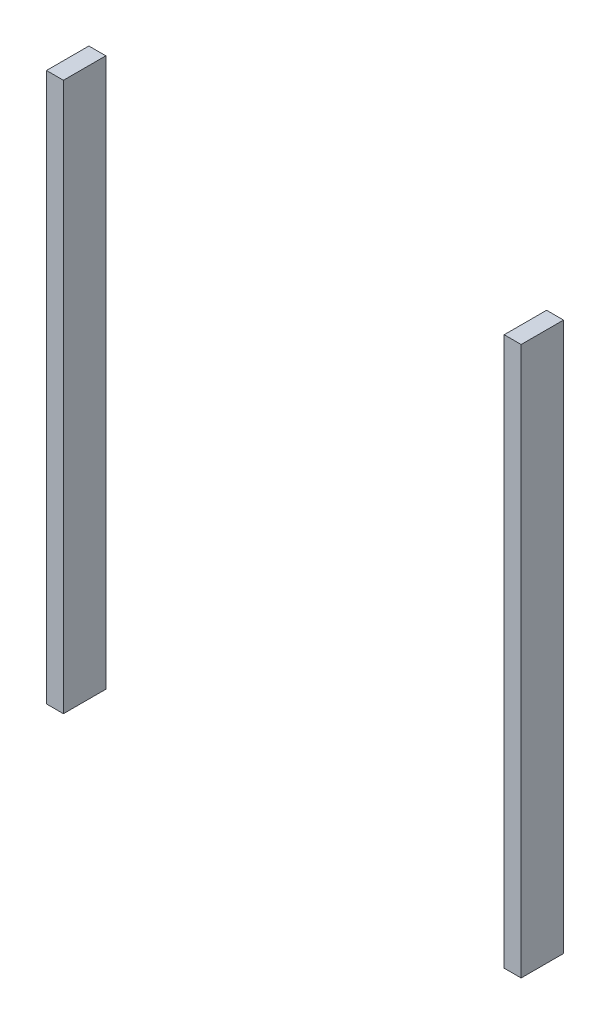
ISO-10303-21;
HEADER;
FILE_DESCRIPTION(('STEP AP214'),'2;1');
FILE_NAME('part.step','',(''),(''),'','','');
FILE_SCHEMA(('AUTOMOTIVE_DESIGN { 1 0 10303 214 1 1 1 1 }'));
ENDSEC;
DATA;
#1=APPLICATION_CONTEXT('core data for automotive mechanical design processes');
#2=APPLICATION_PROTOCOL_DEFINITION('international standard','automotive_design',2000,#1);
#3=PRODUCT_CONTEXT('',#1,'mechanical');
#4=PRODUCT('Part','Part','',(#3));
#5=PRODUCT_RELATED_PRODUCT_CATEGORY('part','',(#4));
#6=PRODUCT_DEFINITION_FORMATION('','',#4);
#7=PRODUCT_DEFINITION_CONTEXT('part definition',#1,'design');
#8=PRODUCT_DEFINITION('design','',#6,#7);
#9=PRODUCT_DEFINITION_SHAPE('','',#8);
#10=(LENGTH_UNIT() NAMED_UNIT(*) SI_UNIT(.MILLI.,.METRE.));
#11=(NAMED_UNIT(*) PLANE_ANGLE_UNIT() SI_UNIT($,.RADIAN.));
#12=(NAMED_UNIT(*) SI_UNIT($,.STERADIAN.) SOLID_ANGLE_UNIT());
#13=UNCERTAINTY_MEASURE_WITH_UNIT(LENGTH_MEASURE(1.E-05),#10,'distance_accuracy_value','');
#14=(GEOMETRIC_REPRESENTATION_CONTEXT(3) GLOBAL_UNCERTAINTY_ASSIGNED_CONTEXT((#13)) GLOBAL_UNIT_ASSIGNED_CONTEXT((#10,
#11,#12)) REPRESENTATION_CONTEXT('',''));
#15=CARTESIAN_POINT('',(0.,0.,0.));
#16=DIRECTION('',(0.,0.,1.));
#17=DIRECTION('',(1.,0.,0.));
#18=AXIS2_PLACEMENT_3D('',#15,#16,#17);
#19=CARTESIAN_POINT('',(65.,-72.0666671000469,6.25));
#20=DIRECTION('',(1.,0.,0.));
#21=DIRECTION('',(0.,0.,-1.));
#22=AXIS2_PLACEMENT_3D('',#19,#20,#21);
#23=PLANE('',#22);
#24=DIRECTION('',(0.,-1.,0.));
#25=VECTOR('',#24,1.);
#26=CARTESIAN_POINT('',(65.,-72.0666671000469,-6.25));
#27=LINE('',#26,#25);
#28=CARTESIAN_POINT('',(65.,89.7489701196322,-6.25));
#29=VERTEX_POINT('',#28);
#30=CARTESIAN_POINT('',(65.,-72.0666671000469,-6.25));
#31=VERTEX_POINT('',#30);
#32=EDGE_CURVE('E12',#29,#31,#27,.T.);
#33=ORIENTED_EDGE('',*,*,#32,.T.);
#34=DIRECTION('',(0.,0.,-1.));
#35=VECTOR('',#34,1.);
#36=CARTESIAN_POINT('',(65.,-72.0666671000469,6.25));
#37=LINE('',#36,#35);
#38=CARTESIAN_POINT('',(65.,-72.0666671000469,6.25));
#39=VERTEX_POINT('',#38);
#40=EDGE_CURVE('E124',#39,#31,#37,.T.);
#41=ORIENTED_EDGE('',*,*,#40,.F.);
#42=DIRECTION('',(0.,-1.,0.));
#43=VECTOR('',#42,1.);
#44=CARTESIAN_POINT('',(65.,-72.0666671000469,6.25));
#45=LINE('',#44,#43);
#46=CARTESIAN_POINT('',(65.,89.7489701196322,6.25));
#47=VERTEX_POINT('',#46);
#48=EDGE_CURVE('E57',#47,#39,#45,.T.);
#49=ORIENTED_EDGE('',*,*,#48,.F.);
#50=DIRECTION('',(0.,0.,-1.));
#51=VECTOR('',#50,1.);
#52=CARTESIAN_POINT('',(65.,89.7489701196322,6.25));
#53=LINE('',#52,#51);
#54=EDGE_CURVE('E112',#47,#29,#53,.T.);
#55=ORIENTED_EDGE('',*,*,#54,.T.);
#56=EDGE_LOOP('',(#33,#41,#49,#55));
#57=FACE_BOUND('',#56,.T.);
#58=ADVANCED_FACE('F53',(#57),#23,.F.);
#59=CARTESIAN_POINT('',(65.,-72.0666671000469,6.25));
#60=DIRECTION('',(0.,1.,0.));
#61=DIRECTION('',(0.,0.,1.));
#62=AXIS2_PLACEMENT_3D('',#59,#60,#61);
#63=PLANE('',#62);
#64=DIRECTION('',(1.,0.,0.));
#65=VECTOR('',#64,1.);
#66=CARTESIAN_POINT('',(65.,-72.0666671000469,-6.25));
#67=LINE('',#66,#65);
#68=CARTESIAN_POINT('',(70.,-72.0666671000469,-6.25));
#69=VERTEX_POINT('',#68);
#70=EDGE_CURVE('E63',#31,#69,#67,.T.);
#71=ORIENTED_EDGE('',*,*,#70,.T.);
#72=DIRECTION('',(0.,0.,-1.));
#73=VECTOR('',#72,1.);
#74=CARTESIAN_POINT('',(70.,-72.0666671000469,6.25));
#75=LINE('',#74,#73);
#76=CARTESIAN_POINT('',(70.,-72.0666671000469,6.25));
#77=VERTEX_POINT('',#76);
#78=EDGE_CURVE('E108',#77,#69,#75,.T.);
#79=ORIENTED_EDGE('',*,*,#78,.F.);
#80=DIRECTION('',(1.,0.,0.));
#81=VECTOR('',#80,1.);
#82=CARTESIAN_POINT('',(65.,-72.0666671000469,6.25));
#83=LINE('',#82,#81);
#84=EDGE_CURVE('E87',#39,#77,#83,.T.);
#85=ORIENTED_EDGE('',*,*,#84,.F.);
#86=ORIENTED_EDGE('',*,*,#40,.T.);
#87=EDGE_LOOP('',(#71,#79,#85,#86));
#88=FACE_BOUND('',#87,.T.);
#89=ADVANCED_FACE('F127',(#88),#63,.F.);
#90=CARTESIAN_POINT('',(70.,-72.0666671000469,6.25));
#91=DIRECTION('',(-1.,0.,0.));
#92=DIRECTION('',(0.,0.,1.));
#93=AXIS2_PLACEMENT_3D('',#90,#91,#92);
#94=PLANE('',#93);
#95=DIRECTION('',(0.,1.,0.));
#96=VECTOR('',#95,1.);
#97=CARTESIAN_POINT('',(70.,-72.0666671000469,-6.25));
#98=LINE('',#97,#96);
#99=CARTESIAN_POINT('',(70.,89.7489701196322,-6.25));
#100=VERTEX_POINT('',#99);
#101=EDGE_CURVE('E103',#69,#100,#98,.T.);
#102=ORIENTED_EDGE('',*,*,#101,.T.);
#103=DIRECTION('',(0.,0.,-1.));
#104=VECTOR('',#103,1.);
#105=CARTESIAN_POINT('',(70.,89.7489701196322,6.25));
#106=LINE('',#105,#104);
#107=CARTESIAN_POINT('',(70.,89.7489701196322,6.25));
#108=VERTEX_POINT('',#107);
#109=EDGE_CURVE('E106',#108,#100,#106,.T.);
#110=ORIENTED_EDGE('',*,*,#109,.F.);
#111=DIRECTION('',(0.,1.,0.));
#112=VECTOR('',#111,1.);
#113=CARTESIAN_POINT('',(70.,-72.0666671000469,6.25));
#114=LINE('',#113,#112);
#115=EDGE_CURVE('E120',#77,#108,#114,.T.);
#116=ORIENTED_EDGE('',*,*,#115,.F.);
#117=ORIENTED_EDGE('',*,*,#78,.T.);
#118=EDGE_LOOP('',(#102,#110,#116,#117));
#119=FACE_BOUND('',#118,.T.);
#120=ADVANCED_FACE('F104',(#119),#94,.F.);
#121=CARTESIAN_POINT('',(65.,89.7489701196322,6.25));
#122=DIRECTION('',(0.,-1.,0.));
#123=DIRECTION('',(0.,0.,-1.));
#124=AXIS2_PLACEMENT_3D('',#121,#122,#123);
#125=PLANE('',#124);
#126=DIRECTION('',(-1.,0.,0.));
#127=VECTOR('',#126,1.);
#128=CARTESIAN_POINT('',(65.,89.7489701196322,-6.25));
#129=LINE('',#128,#127);
#130=EDGE_CURVE('E97',#100,#29,#129,.T.);
#131=ORIENTED_EDGE('',*,*,#130,.T.);
#132=ORIENTED_EDGE('',*,*,#54,.F.);
#133=DIRECTION('',(-1.,0.,0.));
#134=VECTOR('',#133,1.);
#135=CARTESIAN_POINT('',(65.,89.7489701196322,6.25));
#136=LINE('',#135,#134);
#137=EDGE_CURVE('E111',#108,#47,#136,.T.);
#138=ORIENTED_EDGE('',*,*,#137,.F.);
#139=ORIENTED_EDGE('',*,*,#109,.T.);
#140=EDGE_LOOP('',(#131,#132,#138,#139));
#141=FACE_BOUND('',#140,.T.);
#142=ADVANCED_FACE('F110',(#141),#125,.F.);
#143=CARTESIAN_POINT('',(0.,0.,6.25));
#144=DIRECTION('',(0.,0.,-1.));
#145=DIRECTION('',(-1.,0.,0.));
#146=AXIS2_PLACEMENT_3D('',#143,#144,#145);
#147=PLANE('',#146);
#148=ORIENTED_EDGE('',*,*,#48,.T.);
#149=ORIENTED_EDGE('',*,*,#84,.T.);
#150=ORIENTED_EDGE('',*,*,#115,.T.);
#151=ORIENTED_EDGE('',*,*,#137,.T.);
#152=EDGE_LOOP('',(#148,#149,#150,#151));
#153=FACE_BOUND('',#152,.T.);
#154=ADVANCED_FACE('F55',(#153),#147,.F.);
#155=CARTESIAN_POINT('',(0.,0.,-6.25));
#156=DIRECTION('',(0.,0.,-1.));
#157=DIRECTION('',(-1.,0.,0.));
#158=AXIS2_PLACEMENT_3D('',#155,#156,#157);
#159=PLANE('',#158);
#160=ORIENTED_EDGE('',*,*,#32,.F.);
#161=ORIENTED_EDGE('',*,*,#130,.F.);
#162=ORIENTED_EDGE('',*,*,#101,.F.);
#163=ORIENTED_EDGE('',*,*,#70,.F.);
#164=EDGE_LOOP('',(#160,#161,#162,#163));
#165=FACE_BOUND('',#164,.T.);
#166=ADVANCED_FACE('F114',(#165),#159,.T.);
#167=CLOSED_SHELL('',(#58,#89,#120,#142,#154,#166));
#168=MANIFOLD_SOLID_BREP('B2',#167);
#169=CARTESIAN_POINT('',(-65.,89.7489701196322,6.25));
#170=DIRECTION('',(-1.,0.,0.));
#171=DIRECTION('',(0.,0.,1.));
#172=AXIS2_PLACEMENT_3D('',#169,#170,#171);
#173=PLANE('',#172);
#174=DIRECTION('',(0.,1.,0.));
#175=VECTOR('',#174,1.);
#176=CARTESIAN_POINT('',(-65.,89.7489701196322,-6.25));
#177=LINE('',#176,#175);
#178=CARTESIAN_POINT('',(-65.,-72.0666671000469,-6.25));
#179=VERTEX_POINT('',#178);
#180=CARTESIAN_POINT('',(-65.,89.7489701196322,-6.25));
#181=VERTEX_POINT('',#180);
#182=EDGE_CURVE('E240',#179,#181,#177,.T.);
#183=ORIENTED_EDGE('',*,*,#182,.T.);
#184=DIRECTION('',(0.,0.,-1.));
#185=VECTOR('',#184,1.);
#186=CARTESIAN_POINT('',(-65.,89.7489701196322,6.25));
#187=LINE('',#186,#185);
#188=CARTESIAN_POINT('',(-65.,89.7489701196322,6.25));
#189=VERTEX_POINT('',#188);
#190=EDGE_CURVE('E51',#189,#181,#187,.T.);
#191=ORIENTED_EDGE('',*,*,#190,.F.);
#192=DIRECTION('',(0.,1.,0.));
#193=VECTOR('',#192,1.);
#194=CARTESIAN_POINT('',(-65.,89.7489701196322,6.25));
#195=LINE('',#194,#193);
#196=CARTESIAN_POINT('',(-65.,-72.0666671000469,6.25));
#197=VERTEX_POINT('',#196);
#198=EDGE_CURVE('E228',#197,#189,#195,.T.);
#199=ORIENTED_EDGE('',*,*,#198,.F.);
#200=DIRECTION('',(0.,0.,-1.));
#201=VECTOR('',#200,1.);
#202=CARTESIAN_POINT('',(-65.,-72.0666671000469,6.25));
#203=LINE('',#202,#201);
#204=EDGE_CURVE('E236',#197,#179,#203,.T.);
#205=ORIENTED_EDGE('',*,*,#204,.T.);
#206=EDGE_LOOP('',(#183,#191,#199,#205));
#207=FACE_BOUND('',#206,.T.);
#208=ADVANCED_FACE('F177',(#207),#173,.F.);
#209=CARTESIAN_POINT('',(-65.,89.7489701196322,6.25));
#210=DIRECTION('',(0.,-1.,0.));
#211=DIRECTION('',(0.,0.,-1.));
#212=AXIS2_PLACEMENT_3D('',#209,#210,#211);
#213=PLANE('',#212);
#214=DIRECTION('',(-1.,0.,0.));
#215=VECTOR('',#214,1.);
#216=CARTESIAN_POINT('',(-65.,89.7489701196322,-6.25));
#217=LINE('',#216,#215);
#218=CARTESIAN_POINT('',(-70.,89.7489701196322,-6.25));
#219=VERTEX_POINT('',#218);
#220=EDGE_CURVE('E232',#181,#219,#217,.T.);
#221=ORIENTED_EDGE('',*,*,#220,.T.);
#222=DIRECTION('',(0.,0.,-1.));
#223=VECTOR('',#222,1.);
#224=CARTESIAN_POINT('',(-70.,89.7489701196322,6.25));
#225=LINE('',#224,#223);
#226=CARTESIAN_POINT('',(-70.,89.7489701196322,6.25));
#227=VERTEX_POINT('',#226);
#228=EDGE_CURVE('E185',#227,#219,#225,.T.);
#229=ORIENTED_EDGE('',*,*,#228,.F.);
#230=DIRECTION('',(-1.,0.,0.));
#231=VECTOR('',#230,1.);
#232=CARTESIAN_POINT('',(-65.,89.7489701196322,6.25));
#233=LINE('',#232,#231);
#234=EDGE_CURVE('E223',#189,#227,#233,.T.);
#235=ORIENTED_EDGE('',*,*,#234,.F.);
#236=ORIENTED_EDGE('',*,*,#190,.T.);
#237=EDGE_LOOP('',(#221,#229,#235,#236));
#238=FACE_BOUND('',#237,.T.);
#239=ADVANCED_FACE('F231',(#238),#213,.F.);
#240=CARTESIAN_POINT('',(-70.,-72.0666671000469,6.25));
#241=DIRECTION('',(1.,0.,0.));
#242=DIRECTION('',(0.,0.,-1.));
#243=AXIS2_PLACEMENT_3D('',#240,#241,#242);
#244=PLANE('',#243);
#245=DIRECTION('',(0.,-1.,0.));
#246=VECTOR('',#245,1.);
#247=CARTESIAN_POINT('',(-70.,-72.0666671000469,-6.25));
#248=LINE('',#247,#246);
#249=CARTESIAN_POINT('',(-70.,-72.0666671000469,-6.25));
#250=VERTEX_POINT('',#249);
#251=EDGE_CURVE('E210',#219,#250,#248,.T.);
#252=ORIENTED_EDGE('',*,*,#251,.T.);
#253=DIRECTION('',(0.,0.,-1.));
#254=VECTOR('',#253,1.);
#255=CARTESIAN_POINT('',(-70.,-72.0666671000469,6.25));
#256=LINE('',#255,#254);
#257=CARTESIAN_POINT('',(-70.,-72.0666671000469,6.25));
#258=VERTEX_POINT('',#257);
#259=EDGE_CURVE('E233',#258,#250,#256,.T.);
#260=ORIENTED_EDGE('',*,*,#259,.F.);
#261=DIRECTION('',(0.,-1.,0.));
#262=VECTOR('',#261,1.);
#263=CARTESIAN_POINT('',(-70.,-72.0666671000469,6.25));
#264=LINE('',#263,#262);
#265=EDGE_CURVE('E226',#227,#258,#264,.T.);
#266=ORIENTED_EDGE('',*,*,#265,.F.);
#267=ORIENTED_EDGE('',*,*,#228,.T.);
#268=EDGE_LOOP('',(#252,#260,#266,#267));
#269=FACE_BOUND('',#268,.T.);
#270=ADVANCED_FACE('F234',(#269),#244,.F.);
#271=CARTESIAN_POINT('',(-65.,-72.0666671000469,6.25));
#272=DIRECTION('',(0.,1.,0.));
#273=DIRECTION('',(0.,0.,1.));
#274=AXIS2_PLACEMENT_3D('',#271,#272,#273);
#275=PLANE('',#274);
#276=DIRECTION('',(1.,0.,0.));
#277=VECTOR('',#276,1.);
#278=CARTESIAN_POINT('',(-65.,-72.0666671000469,-6.25));
#279=LINE('',#278,#277);
#280=EDGE_CURVE('E216',#250,#179,#279,.T.);
#281=ORIENTED_EDGE('',*,*,#280,.T.);
#282=ORIENTED_EDGE('',*,*,#204,.F.);
#283=DIRECTION('',(1.,0.,0.));
#284=VECTOR('',#283,1.);
#285=CARTESIAN_POINT('',(-65.,-72.0666671000469,6.25));
#286=LINE('',#285,#284);
#287=EDGE_CURVE('E193',#258,#197,#286,.T.);
#288=ORIENTED_EDGE('',*,*,#287,.F.);
#289=ORIENTED_EDGE('',*,*,#259,.T.);
#290=EDGE_LOOP('',(#281,#282,#288,#289));
#291=FACE_BOUND('',#290,.T.);
#292=ADVANCED_FACE('F247',(#291),#275,.F.);
#293=CARTESIAN_POINT('',(0.,0.,6.25));
#294=DIRECTION('',(0.,0.,-1.));
#295=DIRECTION('',(-1.,0.,0.));
#296=AXIS2_PLACEMENT_3D('',#293,#294,#295);
#297=PLANE('',#296);
#298=ORIENTED_EDGE('',*,*,#198,.T.);
#299=ORIENTED_EDGE('',*,*,#234,.T.);
#300=ORIENTED_EDGE('',*,*,#265,.T.);
#301=ORIENTED_EDGE('',*,*,#287,.T.);
#302=EDGE_LOOP('',(#298,#299,#300,#301));
#303=FACE_BOUND('',#302,.T.);
#304=ADVANCED_FACE('F224',(#303),#297,.F.);
#305=CARTESIAN_POINT('',(0.,0.,-6.25));
#306=DIRECTION('',(0.,0.,-1.));
#307=DIRECTION('',(-1.,0.,0.));
#308=AXIS2_PLACEMENT_3D('',#305,#306,#307);
#309=PLANE('',#308);
#310=ORIENTED_EDGE('',*,*,#182,.F.);
#311=ORIENTED_EDGE('',*,*,#280,.F.);
#312=ORIENTED_EDGE('',*,*,#251,.F.);
#313=ORIENTED_EDGE('',*,*,#220,.F.);
#314=EDGE_LOOP('',(#310,#311,#312,#313));
#315=FACE_BOUND('',#314,.T.);
#316=ADVANCED_FACE('F250',(#315),#309,.T.);
#317=CLOSED_SHELL('',(#208,#239,#270,#292,#304,#316));
#318=MANIFOLD_SOLID_BREP('B6',#317);
#319=ADVANCED_BREP_SHAPE_REPRESENTATION('',(#18,#168,#318),#14);
#320=SHAPE_DEFINITION_REPRESENTATION(#9,#319);
ENDSEC;
END-ISO-10303-21;
